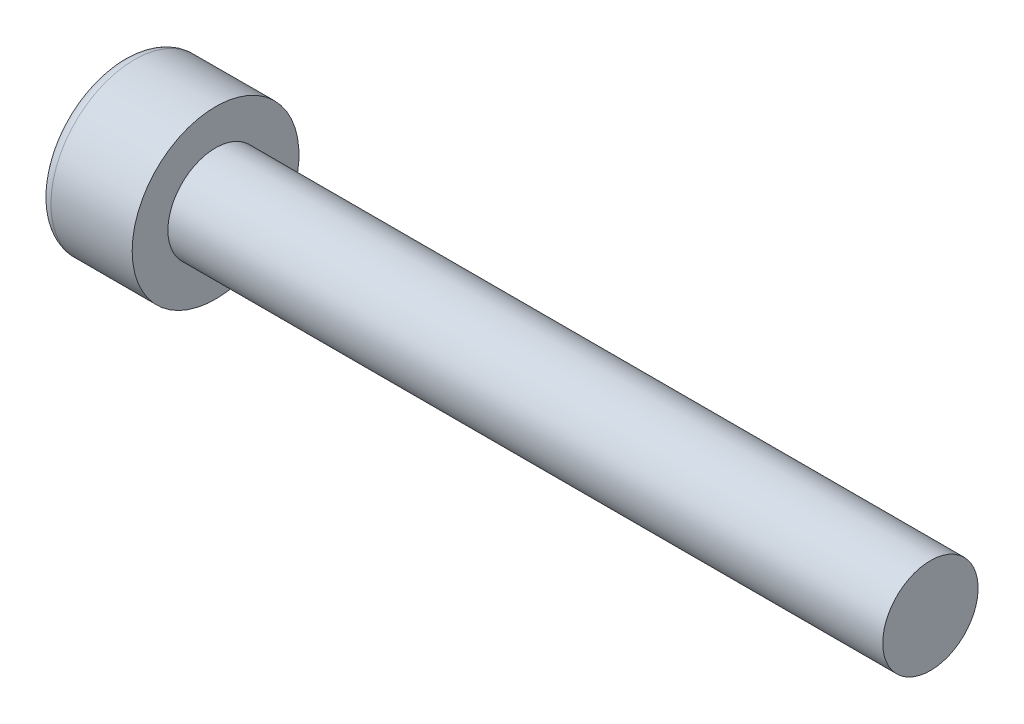
ISO-10303-21;
HEADER;
FILE_DESCRIPTION(('STEP AP214'),'2;1');
FILE_NAME('part.step','',(''),(''),'','','');
FILE_SCHEMA(('AUTOMOTIVE_DESIGN { 1 0 10303 214 1 1 1 1 }'));
ENDSEC;
DATA;
#1=APPLICATION_CONTEXT('core data for automotive mechanical design processes');
#2=APPLICATION_PROTOCOL_DEFINITION('international standard','automotive_design',2000,#1);
#3=PRODUCT_CONTEXT('',#1,'mechanical');
#4=PRODUCT('Part','Part','',(#3));
#5=PRODUCT_RELATED_PRODUCT_CATEGORY('part','',(#4));
#6=PRODUCT_DEFINITION_FORMATION('','',#4);
#7=PRODUCT_DEFINITION_CONTEXT('part definition',#1,'design');
#8=PRODUCT_DEFINITION('design','',#6,#7);
#9=PRODUCT_DEFINITION_SHAPE('','',#8);
#10=(LENGTH_UNIT() NAMED_UNIT(*) SI_UNIT(.MILLI.,.METRE.));
#11=(NAMED_UNIT(*) PLANE_ANGLE_UNIT() SI_UNIT($,.RADIAN.));
#12=(NAMED_UNIT(*) SI_UNIT($,.STERADIAN.) SOLID_ANGLE_UNIT());
#13=UNCERTAINTY_MEASURE_WITH_UNIT(LENGTH_MEASURE(1.E-05),#10,'distance_accuracy_value','');
#14=(GEOMETRIC_REPRESENTATION_CONTEXT(3) GLOBAL_UNCERTAINTY_ASSIGNED_CONTEXT((#13)) GLOBAL_UNIT_ASSIGNED_CONTEXT((#10,
#11,#12)) REPRESENTATION_CONTEXT('',''));
#15=CARTESIAN_POINT('',(0.,0.,0.));
#16=DIRECTION('',(0.,0.,1.));
#17=DIRECTION('',(1.,0.,0.));
#18=AXIS2_PLACEMENT_3D('',#15,#16,#17);
#19=CARTESIAN_POINT('',(0.,0.,0.));
#20=DIRECTION('',(1.,0.,0.));
#21=DIRECTION('',(0.,0.,-1.));
#22=AXIS2_PLACEMENT_3D('',#19,#20,#21);
#23=PLANE('',#22);
#24=CARTESIAN_POINT('',(0.,0.,0.));
#25=DIRECTION('',(1.,0.,0.));
#26=DIRECTION('',(0.,0.,-1.));
#27=AXIS2_PLACEMENT_3D('',#24,#25,#26);
#28=CIRCLE('',#27,3.);
#29=CARTESIAN_POINT('',(0.,0.,-3.));
#30=VERTEX_POINT('',#29);
#31=EDGE_CURVE('E47',#30,#30,#28,.F.);
#32=ORIENTED_EDGE('',*,*,#31,.T.);
#33=EDGE_LOOP('',(#32));
#34=FACE_BOUND('',#33,.T.);
#35=DIRECTION('',(0.,-0.866025403784439,0.5));
#36=VECTOR('',#35,1.);
#37=CARTESIAN_POINT('',(0.,0.,-1.73205080756888));
#38=LINE('',#37,#36);
#39=CARTESIAN_POINT('',(0.,0.,-1.73205080756888));
#40=VERTEX_POINT('',#39);
#41=CARTESIAN_POINT('',(0.,-1.5,-0.866025403784439));
#42=VERTEX_POINT('',#41);
#43=EDGE_CURVE('E128',#40,#42,#38,.T.);
#44=ORIENTED_EDGE('',*,*,#43,.F.);
#45=DIRECTION('',(0.,-0.866025403784439,-0.5));
#46=VECTOR('',#45,1.);
#47=CARTESIAN_POINT('',(0.,1.5,-0.866025403784439));
#48=LINE('',#47,#46);
#49=CARTESIAN_POINT('',(0.,1.5,-0.866025403784439));
#50=VERTEX_POINT('',#49);
#51=EDGE_CURVE('E54',#50,#40,#48,.T.);
#52=ORIENTED_EDGE('',*,*,#51,.F.);
#53=DIRECTION('',(0.,0.,-1.));
#54=VECTOR('',#53,1.);
#55=CARTESIAN_POINT('',(0.,1.5,0.86602540378444));
#56=LINE('',#55,#54);
#57=CARTESIAN_POINT('',(0.,1.5,0.86602540378444));
#58=VERTEX_POINT('',#57);
#59=EDGE_CURVE('E137',#58,#50,#56,.T.);
#60=ORIENTED_EDGE('',*,*,#59,.F.);
#61=DIRECTION('',(0.,0.866025403784439,-0.5));
#62=VECTOR('',#61,1.);
#63=CARTESIAN_POINT('',(0.,0.,1.73205080756888));
#64=LINE('',#63,#62);
#65=CARTESIAN_POINT('',(0.,0.,1.73205080756888));
#66=VERTEX_POINT('',#65);
#67=EDGE_CURVE('E135',#66,#58,#64,.T.);
#68=ORIENTED_EDGE('',*,*,#67,.F.);
#69=DIRECTION('',(0.,0.866025403784439,0.5));
#70=VECTOR('',#69,1.);
#71=CARTESIAN_POINT('',(0.,-1.5,0.866025403784438));
#72=LINE('',#71,#70);
#73=CARTESIAN_POINT('',(0.,-1.5,0.866025403784438));
#74=VERTEX_POINT('',#73);
#75=EDGE_CURVE('E102',#74,#66,#72,.T.);
#76=ORIENTED_EDGE('',*,*,#75,.F.);
#77=DIRECTION('',(0.,0.,1.));
#78=VECTOR('',#77,1.);
#79=CARTESIAN_POINT('',(0.,-1.5,-0.866025403784439));
#80=LINE('',#79,#78);
#81=EDGE_CURVE('E131',#42,#74,#80,.T.);
#82=ORIENTED_EDGE('',*,*,#81,.F.);
#83=EDGE_LOOP('',(#44,#52,#60,#68,#76,#82));
#84=FACE_BOUND('',#83,.T.);
#85=ADVANCED_FACE('F39',(#34,#84),#23,.F.);
#86=CARTESIAN_POINT('',(0.,0.,0.));
#87=DIRECTION('',(-1.,0.,0.));
#88=DIRECTION('',(0.,0.,1.));
#89=AXIS2_PLACEMENT_3D('',#86,#87,#88);
#90=CYLINDRICAL_SURFACE('',#89,3.5);
#91=CARTESIAN_POINT('',(0.5,0.,0.));
#92=DIRECTION('',(1.,0.,0.));
#93=DIRECTION('',(0.,0.,-1.));
#94=AXIS2_PLACEMENT_3D('',#91,#92,#93);
#95=CIRCLE('',#94,3.5);
#96=CARTESIAN_POINT('',(0.5,0.,-3.5));
#97=VERTEX_POINT('',#96);
#98=EDGE_CURVE('E11',#97,#97,#95,.T.);
#99=ORIENTED_EDGE('',*,*,#98,.T.);
#100=EDGE_LOOP('',(#99));
#101=FACE_BOUND('',#100,.T.);
#102=CARTESIAN_POINT('',(3.91,0.,0.));
#103=DIRECTION('',(-1.,0.,0.));
#104=DIRECTION('',(0.,0.,1.));
#105=AXIS2_PLACEMENT_3D('',#102,#103,#104);
#106=CIRCLE('',#105,3.5);
#107=CARTESIAN_POINT('',(3.91,0.,3.5));
#108=VERTEX_POINT('',#107);
#109=EDGE_CURVE('E152',#108,#108,#106,.T.);
#110=ORIENTED_EDGE('',*,*,#109,.T.);
#111=EDGE_LOOP('',(#110));
#112=FACE_BOUND('',#111,.T.);
#113=ADVANCED_FACE('F168',(#101,#112),#90,.T.);
#114=CARTESIAN_POINT('',(3.91,3.5,0.));
#115=DIRECTION('',(-1.,0.,0.));
#116=DIRECTION('',(0.,0.,1.));
#117=AXIS2_PLACEMENT_3D('',#114,#115,#116);
#118=PLANE('',#117);
#119=ORIENTED_EDGE('',*,*,#109,.F.);
#120=EDGE_LOOP('',(#119));
#121=FACE_BOUND('',#120,.T.);
#122=CARTESIAN_POINT('',(3.91,0.,0.));
#123=DIRECTION('',(-1.,0.,0.));
#124=DIRECTION('',(0.,0.,1.));
#125=AXIS2_PLACEMENT_3D('',#122,#123,#124);
#126=CIRCLE('',#125,2.);
#127=CARTESIAN_POINT('',(3.91,0.,2.));
#128=VERTEX_POINT('',#127);
#129=EDGE_CURVE('E149',#128,#128,#126,.T.);
#130=ORIENTED_EDGE('',*,*,#129,.T.);
#131=EDGE_LOOP('',(#130));
#132=FACE_BOUND('',#131,.T.);
#133=ADVANCED_FACE('F172',(#121,#132),#118,.F.);
#134=CARTESIAN_POINT('',(0.,0.,0.));
#135=DIRECTION('',(-1.,0.,0.));
#136=DIRECTION('',(0.,0.,1.));
#137=AXIS2_PLACEMENT_3D('',#134,#135,#136);
#138=CYLINDRICAL_SURFACE('',#137,2.);
#139=ORIENTED_EDGE('',*,*,#129,.F.);
#140=EDGE_LOOP('',(#139));
#141=FACE_BOUND('',#140,.T.);
#142=CARTESIAN_POINT('',(33.91,0.,0.));
#143=DIRECTION('',(-1.,0.,0.));
#144=DIRECTION('',(0.,0.,1.));
#145=AXIS2_PLACEMENT_3D('',#142,#143,#144);
#146=CIRCLE('',#145,2.);
#147=CARTESIAN_POINT('',(33.91,0.,2.));
#148=VERTEX_POINT('',#147);
#149=EDGE_CURVE('E141',#148,#148,#146,.T.);
#150=ORIENTED_EDGE('',*,*,#149,.T.);
#151=EDGE_LOOP('',(#150));
#152=FACE_BOUND('',#151,.T.);
#153=ADVANCED_FACE('F178',(#141,#152),#138,.T.);
#154=CARTESIAN_POINT('',(33.91,2.,0.));
#155=DIRECTION('',(-1.,0.,0.));
#156=DIRECTION('',(0.,0.,1.));
#157=AXIS2_PLACEMENT_3D('',#154,#155,#156);
#158=PLANE('',#157);
#159=ORIENTED_EDGE('',*,*,#149,.F.);
#160=EDGE_LOOP('',(#159));
#161=FACE_BOUND('',#160,.T.);
#162=ADVANCED_FACE('F182',(#161),#158,.F.);
#163=CARTESIAN_POINT('',(2.,1.5,-0.866025403784439));
#164=DIRECTION('',(0.,0.5,-0.866025403784439));
#165=DIRECTION('',(0.,0.866025403784439,0.5));
#166=AXIS2_PLACEMENT_3D('',#163,#164,#165);
#167=PLANE('',#166);
#168=ORIENTED_EDGE('',*,*,#51,.T.);
#169=DIRECTION('',(-1.,0.,0.));
#170=VECTOR('',#169,1.);
#171=CARTESIAN_POINT('',(2.,0.,-1.73205080756888));
#172=LINE('',#171,#170);
#173=CARTESIAN_POINT('',(2.,0.,-1.73205080756888));
#174=VERTEX_POINT('',#173);
#175=EDGE_CURVE('E84',#174,#40,#172,.T.);
#176=ORIENTED_EDGE('',*,*,#175,.F.);
#177=DIRECTION('',(0.,-0.866025403784439,-0.5));
#178=VECTOR('',#177,1.);
#179=CARTESIAN_POINT('',(2.,1.5,-0.866025403784439));
#180=LINE('',#179,#178);
#181=CARTESIAN_POINT('',(2.,1.5,-0.866025403784439));
#182=VERTEX_POINT('',#181);
#183=EDGE_CURVE('E139',#182,#174,#180,.T.);
#184=ORIENTED_EDGE('',*,*,#183,.F.);
#185=DIRECTION('',(-1.,0.,0.));
#186=VECTOR('',#185,1.);
#187=CARTESIAN_POINT('',(2.,1.5,-0.866025403784439));
#188=LINE('',#187,#186);
#189=EDGE_CURVE('E62',#182,#50,#188,.T.);
#190=ORIENTED_EDGE('',*,*,#189,.T.);
#191=EDGE_LOOP('',(#168,#176,#184,#190));
#192=FACE_BOUND('',#191,.T.);
#193=ADVANCED_FACE('F186',(#192),#167,.F.);
#194=CARTESIAN_POINT('',(2.,1.5,0.86602540378444));
#195=DIRECTION('',(0.,1.,0.));
#196=DIRECTION('',(0.,0.,1.));
#197=AXIS2_PLACEMENT_3D('',#194,#195,#196);
#198=PLANE('',#197);
#199=ORIENTED_EDGE('',*,*,#59,.T.);
#200=ORIENTED_EDGE('',*,*,#189,.F.);
#201=DIRECTION('',(0.,0.,-1.));
#202=VECTOR('',#201,1.);
#203=CARTESIAN_POINT('',(2.,1.5,0.86602540378444));
#204=LINE('',#203,#202);
#205=CARTESIAN_POINT('',(2.,1.5,0.86602540378444));
#206=VERTEX_POINT('',#205);
#207=EDGE_CURVE('E114',#206,#182,#204,.T.);
#208=ORIENTED_EDGE('',*,*,#207,.F.);
#209=DIRECTION('',(-1.,0.,0.));
#210=VECTOR('',#209,1.);
#211=CARTESIAN_POINT('',(2.,1.5,0.86602540378444));
#212=LINE('',#211,#210);
#213=EDGE_CURVE('E106',#206,#58,#212,.T.);
#214=ORIENTED_EDGE('',*,*,#213,.T.);
#215=EDGE_LOOP('',(#199,#200,#208,#214));
#216=FACE_BOUND('',#215,.T.);
#217=ADVANCED_FACE('F190',(#216),#198,.F.);
#218=CARTESIAN_POINT('',(2.,0.,1.73205080756888));
#219=DIRECTION('',(0.,0.5,0.866025403784439));
#220=DIRECTION('',(0.,-0.866025403784439,0.5));
#221=AXIS2_PLACEMENT_3D('',#218,#219,#220);
#222=PLANE('',#221);
#223=ORIENTED_EDGE('',*,*,#67,.T.);
#224=ORIENTED_EDGE('',*,*,#213,.F.);
#225=DIRECTION('',(0.,0.866025403784439,-0.5));
#226=VECTOR('',#225,1.);
#227=CARTESIAN_POINT('',(2.,0.,1.73205080756888));
#228=LINE('',#227,#226);
#229=CARTESIAN_POINT('',(2.,0.,1.73205080756888));
#230=VERTEX_POINT('',#229);
#231=EDGE_CURVE('E110',#230,#206,#228,.T.);
#232=ORIENTED_EDGE('',*,*,#231,.F.);
#233=DIRECTION('',(-1.,0.,0.));
#234=VECTOR('',#233,1.);
#235=CARTESIAN_POINT('',(2.,0.,1.73205080756888));
#236=LINE('',#235,#234);
#237=EDGE_CURVE('E95',#230,#66,#236,.T.);
#238=ORIENTED_EDGE('',*,*,#237,.T.);
#239=EDGE_LOOP('',(#223,#224,#232,#238));
#240=FACE_BOUND('',#239,.T.);
#241=ADVANCED_FACE('F111',(#240),#222,.F.);
#242=CARTESIAN_POINT('',(2.,-1.5,0.866025403784438));
#243=DIRECTION('',(0.,-0.5,0.866025403784439));
#244=DIRECTION('',(0.,-0.866025403784439,-0.5));
#245=AXIS2_PLACEMENT_3D('',#242,#243,#244);
#246=PLANE('',#245);
#247=ORIENTED_EDGE('',*,*,#75,.T.);
#248=ORIENTED_EDGE('',*,*,#237,.F.);
#249=DIRECTION('',(0.,0.866025403784439,0.5));
#250=VECTOR('',#249,1.);
#251=CARTESIAN_POINT('',(2.,-1.5,0.866025403784438));
#252=LINE('',#251,#250);
#253=CARTESIAN_POINT('',(2.,-1.5,0.866025403784438));
#254=VERTEX_POINT('',#253);
#255=EDGE_CURVE('E99',#254,#230,#252,.T.);
#256=ORIENTED_EDGE('',*,*,#255,.F.);
#257=DIRECTION('',(-1.,0.,0.));
#258=VECTOR('',#257,1.);
#259=CARTESIAN_POINT('',(2.,-1.5,0.866025403784438));
#260=LINE('',#259,#258);
#261=EDGE_CURVE('E107',#254,#74,#260,.T.);
#262=ORIENTED_EDGE('',*,*,#261,.T.);
#263=EDGE_LOOP('',(#247,#248,#256,#262));
#264=FACE_BOUND('',#263,.T.);
#265=ADVANCED_FACE('F97',(#264),#246,.F.);
#266=CARTESIAN_POINT('',(2.,-1.5,-0.866025403784439));
#267=DIRECTION('',(0.,-1.,0.));
#268=DIRECTION('',(0.,0.,-1.));
#269=AXIS2_PLACEMENT_3D('',#266,#267,#268);
#270=PLANE('',#269);
#271=ORIENTED_EDGE('',*,*,#81,.T.);
#272=ORIENTED_EDGE('',*,*,#261,.F.);
#273=DIRECTION('',(0.,0.,1.));
#274=VECTOR('',#273,1.);
#275=CARTESIAN_POINT('',(2.,-1.5,-0.866025403784439));
#276=LINE('',#275,#274);
#277=CARTESIAN_POINT('',(2.,-1.5,-0.866025403784439));
#278=VERTEX_POINT('',#277);
#279=EDGE_CURVE('E120',#278,#254,#276,.T.);
#280=ORIENTED_EDGE('',*,*,#279,.F.);
#281=DIRECTION('',(-1.,0.,0.));
#282=VECTOR('',#281,1.);
#283=CARTESIAN_POINT('',(2.,-1.5,-0.866025403784439));
#284=LINE('',#283,#282);
#285=EDGE_CURVE('E144',#278,#42,#284,.T.);
#286=ORIENTED_EDGE('',*,*,#285,.T.);
#287=EDGE_LOOP('',(#271,#272,#280,#286));
#288=FACE_BOUND('',#287,.T.);
#289=ADVANCED_FACE('F193',(#288),#270,.F.);
#290=CARTESIAN_POINT('',(2.,0.,-1.73205080756888));
#291=DIRECTION('',(0.,-0.5,-0.866025403784439));
#292=DIRECTION('',(0.,0.866025403784439,-0.5));
#293=AXIS2_PLACEMENT_3D('',#290,#291,#292);
#294=PLANE('',#293);
#295=ORIENTED_EDGE('',*,*,#43,.T.);
#296=ORIENTED_EDGE('',*,*,#285,.F.);
#297=DIRECTION('',(0.,-0.866025403784439,0.5));
#298=VECTOR('',#297,1.);
#299=CARTESIAN_POINT('',(2.,0.,-1.73205080756888));
#300=LINE('',#299,#298);
#301=EDGE_CURVE('E122',#174,#278,#300,.T.);
#302=ORIENTED_EDGE('',*,*,#301,.F.);
#303=ORIENTED_EDGE('',*,*,#175,.T.);
#304=EDGE_LOOP('',(#295,#296,#302,#303));
#305=FACE_BOUND('',#304,.T.);
#306=ADVANCED_FACE('F164',(#305),#294,.F.);
#307=CARTESIAN_POINT('',(2.,0.,0.));
#308=DIRECTION('',(-1.,0.,0.));
#309=DIRECTION('',(0.,0.,1.));
#310=AXIS2_PLACEMENT_3D('',#307,#308,#309);
#311=PLANE('',#310);
#312=ORIENTED_EDGE('',*,*,#183,.T.);
#313=ORIENTED_EDGE('',*,*,#301,.T.);
#314=ORIENTED_EDGE('',*,*,#279,.T.);
#315=ORIENTED_EDGE('',*,*,#255,.T.);
#316=ORIENTED_EDGE('',*,*,#231,.T.);
#317=ORIENTED_EDGE('',*,*,#207,.T.);
#318=EDGE_LOOP('',(#312,#313,#314,#315,#316,#317));
#319=FACE_BOUND('',#318,.T.);
#320=ADVANCED_FACE('F117',(#319),#311,.T.);
#321=CARTESIAN_POINT('',(0.5,0.,0.));
#322=DIRECTION('',(1.,0.,0.));
#323=DIRECTION('',(0.,0.,-1.));
#324=AXIS2_PLACEMENT_3D('',#321,#322,#323);
#325=TOROIDAL_SURFACE('',#324,3.,0.5);
#326=ORIENTED_EDGE('',*,*,#98,.F.);
#327=EDGE_LOOP('',(#326));
#328=FACE_BOUND('',#327,.T.);
#329=ORIENTED_EDGE('',*,*,#31,.F.);
#330=EDGE_LOOP('',(#329));
#331=FACE_BOUND('',#330,.T.);
#332=ADVANCED_FACE('F41',(#328,#331),#325,.T.);
#333=CLOSED_SHELL('',(#85,#113,#133,#153,#162,#193,#217,#241,#265,#289,#306,#320,#332));
#334=MANIFOLD_SOLID_BREP('B2',#333);
#335=ADVANCED_BREP_SHAPE_REPRESENTATION('',(#18,#334),#14);
#336=SHAPE_DEFINITION_REPRESENTATION(#9,#335);
ENDSEC;
END-ISO-10303-21;
